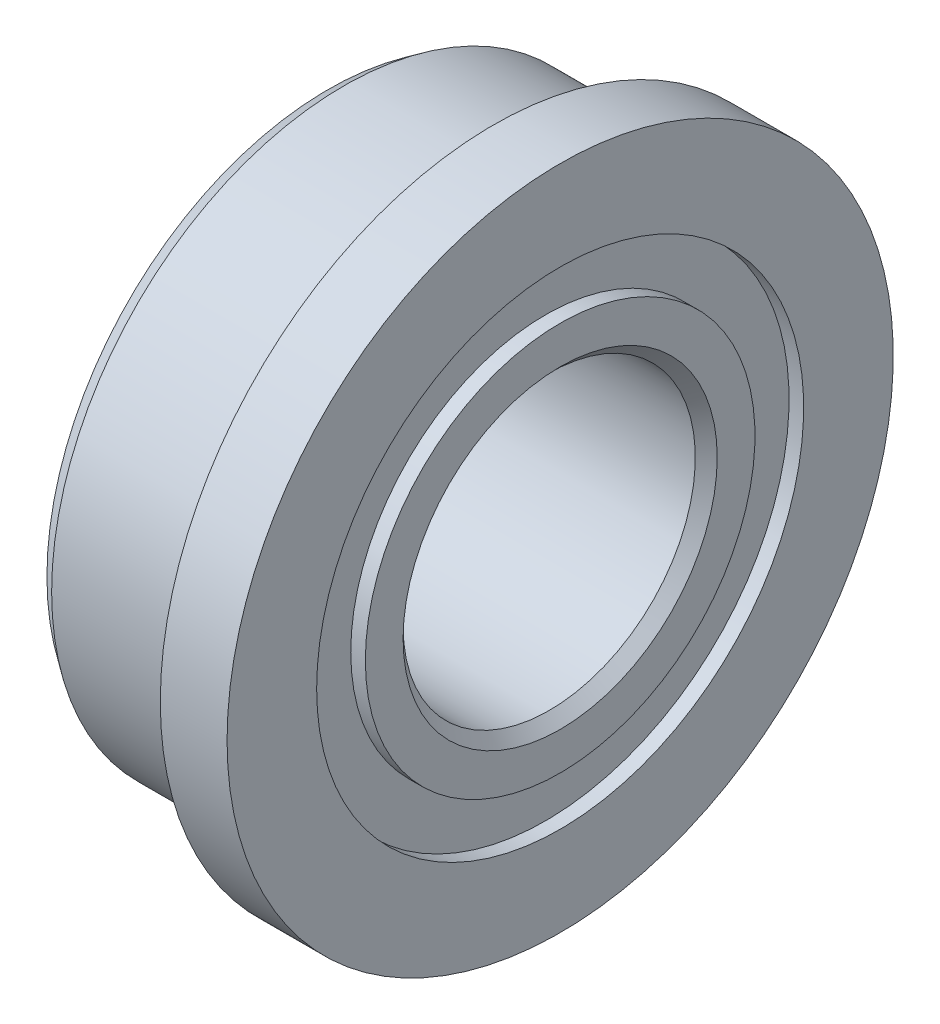
ISO-10303-21;
HEADER;
FILE_DESCRIPTION(('STEP AP214'),'2;1');
FILE_NAME('part.step','',(''),(''),'','','');
FILE_SCHEMA(('AUTOMOTIVE_DESIGN { 1 0 10303 214 1 1 1 1 }'));
ENDSEC;
DATA;
#1=APPLICATION_CONTEXT('core data for automotive mechanical design processes');
#2=APPLICATION_PROTOCOL_DEFINITION('international standard','automotive_design',2000,#1);
#3=PRODUCT_CONTEXT('',#1,'mechanical');
#4=PRODUCT('Part','Part','',(#3));
#5=PRODUCT_RELATED_PRODUCT_CATEGORY('part','',(#4));
#6=PRODUCT_DEFINITION_FORMATION('','',#4);
#7=PRODUCT_DEFINITION_CONTEXT('part definition',#1,'design');
#8=PRODUCT_DEFINITION('design','',#6,#7);
#9=PRODUCT_DEFINITION_SHAPE('','',#8);
#10=(LENGTH_UNIT() NAMED_UNIT(*) SI_UNIT(.MILLI.,.METRE.));
#11=(NAMED_UNIT(*) PLANE_ANGLE_UNIT() SI_UNIT($,.RADIAN.));
#12=(NAMED_UNIT(*) SI_UNIT($,.STERADIAN.) SOLID_ANGLE_UNIT());
#13=UNCERTAINTY_MEASURE_WITH_UNIT(LENGTH_MEASURE(1.E-05),#10,'distance_accuracy_value','');
#14=(GEOMETRIC_REPRESENTATION_CONTEXT(3) GLOBAL_UNCERTAINTY_ASSIGNED_CONTEXT((#13)) GLOBAL_UNIT_ASSIGNED_CONTEXT((#10,
#11,#12)) REPRESENTATION_CONTEXT('',''));
#15=CARTESIAN_POINT('',(0.,0.,0.));
#16=DIRECTION('',(0.,0.,1.));
#17=DIRECTION('',(1.,0.,0.));
#18=AXIS2_PLACEMENT_3D('',#15,#16,#17);
#19=CARTESIAN_POINT('',(-4.0000000000191,-1.89186773885686E-11,0.));
#20=DIRECTION('',(1.,0.,0.));
#21=DIRECTION('',(0.,0.,1.));
#22=AXIS2_PLACEMENT_3D('',#19,#20,#21);
#23=CYLINDRICAL_SURFACE('',#22,3.33333333333333);
#24=CARTESIAN_POINT('',(-2.91107312729798,-1.89186773885686E-11,0.));
#25=DIRECTION('',(-1.,0.,0.));
#26=DIRECTION('',(0.,0.,1.));
#27=AXIS2_PLACEMENT_3D('',#24,#25,#26);
#28=CIRCLE('',#27,3.33333333333333);
#29=CARTESIAN_POINT('',(-2.91107312729798,-1.89186773885686E-11,3.33333333333333));
#30=VERTEX_POINT('',#29);
#31=EDGE_CURVE('E93',#30,#30,#28,.T.);
#32=ORIENTED_EDGE('',*,*,#31,.F.);
#33=EDGE_LOOP('',(#32));
#34=FACE_BOUND('',#33,.T.);
#35=CARTESIAN_POINT('',(-3.17507312736301,-1.89186773885686E-11,0.));
#36=DIRECTION('',(-1.,0.,0.));
#37=DIRECTION('',(0.,0.,1.));
#38=AXIS2_PLACEMENT_3D('',#35,#36,#37);
#39=CIRCLE('',#38,3.33333333333333);
#40=CARTESIAN_POINT('',(-3.17507312736301,-1.89186773885686E-11,3.33333333333333));
#41=VERTEX_POINT('',#40);
#42=EDGE_CURVE('E10',#41,#41,#39,.T.);
#43=ORIENTED_EDGE('',*,*,#42,.T.);
#44=EDGE_LOOP('',(#43));
#45=FACE_BOUND('',#44,.T.);
#46=ADVANCED_FACE('F35',(#34,#45),#23,.F.);
#47=CARTESIAN_POINT('',(-3.17507312736301,3.85010438242014,0.));
#48=DIRECTION('',(-1.,0.,0.));
#49=DIRECTION('',(0.,0.,-1.));
#50=AXIS2_PLACEMENT_3D('',#47,#48,#49);
#51=PLANE('',#50);
#52=ORIENTED_EDGE('',*,*,#42,.F.);
#53=EDGE_LOOP('',(#52));
#54=FACE_BOUND('',#53,.T.);
#55=CARTESIAN_POINT('',(-3.17507312736301,-1.89186773885686E-11,0.));
#56=DIRECTION('',(-1.,0.,0.));
#57=DIRECTION('',(0.,0.,1.));
#58=AXIS2_PLACEMENT_3D('',#55,#56,#57);
#59=CIRCLE('',#58,3.85010438243906);
#60=CARTESIAN_POINT('',(-3.17507312736301,-1.89186773885686E-11,3.85010438243906));
#61=VERTEX_POINT('',#60);
#62=EDGE_CURVE('E41',#61,#61,#59,.T.);
#63=ORIENTED_EDGE('',*,*,#62,.T.);
#64=EDGE_LOOP('',(#63));
#65=FACE_BOUND('',#64,.T.);
#66=ADVANCED_FACE('F100',(#54,#65),#51,.T.);
#67=CARTESIAN_POINT('',(-2.96099999992397,-1.89186773885686E-11,0.));
#68=DIRECTION('',(1.,0.,0.));
#69=DIRECTION('',(0.,0.,1.));
#70=AXIS2_PLACEMENT_3D('',#67,#68,#69);
#71=CONICAL_SURFACE('',#70,4.,0.610865238198014);
#72=ORIENTED_EDGE('',*,*,#62,.F.);
#73=EDGE_LOOP('',(#72));
#74=FACE_BOUND('',#73,.T.);
#75=CARTESIAN_POINT('',(-2.96099999992397,-1.89186773885686E-11,0.));
#76=DIRECTION('',(-1.,0.,0.));
#77=DIRECTION('',(0.,0.,1.));
#78=AXIS2_PLACEMENT_3D('',#75,#76,#77);
#79=CIRCLE('',#78,4.);
#80=CARTESIAN_POINT('',(-2.96099999992397,-1.89186773885686E-11,4.));
#81=VERTEX_POINT('',#80);
#82=EDGE_CURVE('E45',#81,#81,#79,.T.);
#83=ORIENTED_EDGE('',*,*,#82,.T.);
#84=EDGE_LOOP('',(#83));
#85=FACE_BOUND('',#84,.T.);
#86=ADVANCED_FACE('F104',(#74,#85),#71,.T.);
#87=CARTESIAN_POINT('',(-4.0000000000191,-1.89186773885686E-11,0.));
#88=DIRECTION('',(1.,0.,0.));
#89=DIRECTION('',(0.,0.,1.));
#90=AXIS2_PLACEMENT_3D('',#87,#88,#89);
#91=CYLINDRICAL_SURFACE('',#90,4.);
#92=ORIENTED_EDGE('',*,*,#82,.F.);
#93=EDGE_LOOP('',(#92));
#94=FACE_BOUND('',#93,.T.);
#95=CARTESIAN_POINT('',(-0.934073127363007,-1.89186773885686E-11,0.));
#96=DIRECTION('',(-1.,0.,0.));
#97=DIRECTION('',(0.,0.,1.));
#98=AXIS2_PLACEMENT_3D('',#95,#96,#97);
#99=CIRCLE('',#98,4.);
#100=CARTESIAN_POINT('',(-0.934073127363007,-1.89186773885686E-11,4.));
#101=VERTEX_POINT('',#100);
#102=EDGE_CURVE('E49',#101,#101,#99,.T.);
#103=ORIENTED_EDGE('',*,*,#102,.T.);
#104=EDGE_LOOP('',(#103));
#105=FACE_BOUND('',#104,.T.);
#106=ADVANCED_FACE('F109',(#94,#105),#91,.T.);
#107=CARTESIAN_POINT('',(-0.914073127363007,-1.89188942290031E-11,0.));
#108=DIRECTION('',(1.,0.,0.));
#109=DIRECTION('',(0.,0.,1.));
#110=AXIS2_PLACEMENT_3D('',#107,#108,#109);
#111=TOROIDAL_SURFACE('',#110,4.,0.0200000000000001);
#112=ORIENTED_EDGE('',*,*,#102,.F.);
#113=EDGE_LOOP('',(#112));
#114=FACE_BOUND('',#113,.T.);
#115=CARTESIAN_POINT('',(-0.914073127363007,-1.89186773885686E-11,0.));
#116=DIRECTION('',(-1.,0.,0.));
#117=DIRECTION('',(0.,0.,1.));
#118=AXIS2_PLACEMENT_3D('',#115,#116,#117);
#119=CIRCLE('',#118,4.02);
#120=CARTESIAN_POINT('',(-0.914073127363007,-1.89186773885686E-11,4.02));
#121=VERTEX_POINT('',#120);
#122=EDGE_CURVE('E54',#121,#121,#119,.T.);
#123=ORIENTED_EDGE('',*,*,#122,.T.);
#124=EDGE_LOOP('',(#123));
#125=FACE_BOUND('',#124,.T.);
#126=ADVANCED_FACE('F115',(#114,#125),#111,.F.);
#127=CARTESIAN_POINT('',(-0.914073127363007,4.55949999998108,0.));
#128=DIRECTION('',(-1.,0.,0.));
#129=DIRECTION('',(0.,0.,-1.));
#130=AXIS2_PLACEMENT_3D('',#127,#128,#129);
#131=PLANE('',#130);
#132=ORIENTED_EDGE('',*,*,#122,.F.);
#133=EDGE_LOOP('',(#132));
#134=FACE_BOUND('',#133,.T.);
#135=CARTESIAN_POINT('',(-0.914073127363007,-1.89186773885686E-11,0.));
#136=DIRECTION('',(-1.,0.,0.));
#137=DIRECTION('',(0.,0.,1.));
#138=AXIS2_PLACEMENT_3D('',#135,#136,#137);
#139=CIRCLE('',#138,4.5595);
#140=CARTESIAN_POINT('',(-0.914073127363007,-1.89186773885686E-11,4.5595));
#141=VERTEX_POINT('',#140);
#142=EDGE_CURVE('E57',#141,#141,#139,.T.);
#143=ORIENTED_EDGE('',*,*,#142,.T.);
#144=EDGE_LOOP('',(#143));
#145=FACE_BOUND('',#144,.T.);
#146=ADVANCED_FACE('F119',(#134,#145),#131,.T.);
#147=CARTESIAN_POINT('',(-4.0000000000191,-1.89186773885686E-11,0.));
#148=DIRECTION('',(1.,0.,0.));
#149=DIRECTION('',(0.,0.,1.));
#150=AXIS2_PLACEMENT_3D('',#147,#148,#149);
#151=CYLINDRICAL_SURFACE('',#150,4.5595);
#152=ORIENTED_EDGE('',*,*,#142,.F.);
#153=EDGE_LOOP('',(#152));
#154=FACE_BOUND('',#153,.T.);
#155=CARTESIAN_POINT('',(-7.31273630070334E-05,-1.89186773885686E-11,0.));
#156=DIRECTION('',(-1.,0.,0.));
#157=DIRECTION('',(0.,0.,1.));
#158=AXIS2_PLACEMENT_3D('',#155,#156,#157);
#159=CIRCLE('',#158,4.5595);
#160=CARTESIAN_POINT('',(-7.31273630070334E-05,-1.89186773885686E-11,4.5595));
#161=VERTEX_POINT('',#160);
#162=EDGE_CURVE('E60',#161,#161,#159,.T.);
#163=ORIENTED_EDGE('',*,*,#162,.T.);
#164=EDGE_LOOP('',(#163));
#165=FACE_BOUND('',#164,.T.);
#166=ADVANCED_FACE('F123',(#154,#165),#151,.T.);
#167=CARTESIAN_POINT('',(-7.31273630073948E-05,3.33333333331441,0.));
#168=DIRECTION('',(1.,0.,0.));
#169=DIRECTION('',(0.,0.,1.));
#170=AXIS2_PLACEMENT_3D('',#167,#168,#169);
#171=PLANE('',#170);
#172=ORIENTED_EDGE('',*,*,#162,.F.);
#173=EDGE_LOOP('',(#172));
#174=FACE_BOUND('',#173,.T.);
#175=CARTESIAN_POINT('',(-7.31273630070334E-05,-1.89186773885686E-11,0.));
#176=DIRECTION('',(-1.,0.,0.));
#177=DIRECTION('',(0.,0.,1.));
#178=AXIS2_PLACEMENT_3D('',#175,#176,#177);
#179=CIRCLE('',#178,3.33333333333333);
#180=CARTESIAN_POINT('',(-7.31273630070334E-05,-1.89186773885686E-11,3.33333333333333));
#181=VERTEX_POINT('',#180);
#182=EDGE_CURVE('E63',#181,#181,#179,.T.);
#183=ORIENTED_EDGE('',*,*,#182,.T.);
#184=EDGE_LOOP('',(#183));
#185=FACE_BOUND('',#184,.T.);
#186=ADVANCED_FACE('F127',(#174,#185),#171,.T.);
#187=CARTESIAN_POINT('',(-4.0000000000191,-1.89186773885686E-11,0.));
#188=DIRECTION('',(1.,0.,0.));
#189=DIRECTION('',(0.,0.,1.));
#190=AXIS2_PLACEMENT_3D('',#187,#188,#189);
#191=CYLINDRICAL_SURFACE('',#190,3.33333333333333);
#192=ORIENTED_EDGE('',*,*,#182,.F.);
#193=EDGE_LOOP('',(#192));
#194=FACE_BOUND('',#193,.T.);
#195=CARTESIAN_POINT('',(-0.2,-1.89186773885686E-11,0.));
#196=DIRECTION('',(-1.,0.,0.));
#197=DIRECTION('',(0.,0.,1.));
#198=AXIS2_PLACEMENT_3D('',#195,#196,#197);
#199=CIRCLE('',#198,3.33333333333333);
#200=CARTESIAN_POINT('',(-0.2,-1.89186773885686E-11,3.33333333333333));
#201=VERTEX_POINT('',#200);
#202=EDGE_CURVE('E66',#201,#201,#199,.T.);
#203=ORIENTED_EDGE('',*,*,#202,.T.);
#204=EDGE_LOOP('',(#203));
#205=FACE_BOUND('',#204,.T.);
#206=ADVANCED_FACE('F131',(#194,#205),#191,.F.);
#207=CARTESIAN_POINT('',(-0.2,2.66666666664775,0.));
#208=DIRECTION('',(1.,0.,0.));
#209=DIRECTION('',(0.,0.,1.));
#210=AXIS2_PLACEMENT_3D('',#207,#208,#209);
#211=PLANE('',#210);
#212=ORIENTED_EDGE('',*,*,#202,.F.);
#213=EDGE_LOOP('',(#212));
#214=FACE_BOUND('',#213,.T.);
#215=CARTESIAN_POINT('',(-0.2,-1.89186773885686E-11,0.));
#216=DIRECTION('',(-1.,0.,0.));
#217=DIRECTION('',(0.,0.,1.));
#218=AXIS2_PLACEMENT_3D('',#215,#216,#217);
#219=CIRCLE('',#218,2.66666666666667);
#220=CARTESIAN_POINT('',(-0.2,-1.89186773885686E-11,2.66666666666667));
#221=VERTEX_POINT('',#220);
#222=EDGE_CURVE('E69',#221,#221,#219,.T.);
#223=ORIENTED_EDGE('',*,*,#222,.T.);
#224=EDGE_LOOP('',(#223));
#225=FACE_BOUND('',#224,.T.);
#226=ADVANCED_FACE('F135',(#214,#225),#211,.T.);
#227=CARTESIAN_POINT('',(-4.0000000000191,-1.89186773885686E-11,0.));
#228=DIRECTION('',(1.,0.,0.));
#229=DIRECTION('',(0.,0.,1.));
#230=AXIS2_PLACEMENT_3D('',#227,#228,#229);
#231=CYLINDRICAL_SURFACE('',#230,2.66666666666667);
#232=ORIENTED_EDGE('',*,*,#222,.F.);
#233=EDGE_LOOP('',(#232));
#234=FACE_BOUND('',#233,.T.);
#235=CARTESIAN_POINT('',(-7.31273630070334E-05,-1.89186773885686E-11,0.));
#236=DIRECTION('',(-1.,0.,0.));
#237=DIRECTION('',(0.,0.,1.));
#238=AXIS2_PLACEMENT_3D('',#235,#236,#237);
#239=CIRCLE('',#238,2.66666666666667);
#240=CARTESIAN_POINT('',(-7.31273630070334E-05,-1.89186773885686E-11,2.66666666666667));
#241=VERTEX_POINT('',#240);
#242=EDGE_CURVE('E72',#241,#241,#239,.T.);
#243=ORIENTED_EDGE('',*,*,#242,.T.);
#244=EDGE_LOOP('',(#243));
#245=FACE_BOUND('',#244,.T.);
#246=ADVANCED_FACE('F139',(#234,#245),#231,.T.);
#247=CARTESIAN_POINT('',(-7.31273630073834E-05,2.15010438245956,0.));
#248=DIRECTION('',(1.,0.,0.));
#249=DIRECTION('',(0.,0.,1.));
#250=AXIS2_PLACEMENT_3D('',#247,#248,#249);
#251=PLANE('',#250);
#252=ORIENTED_EDGE('',*,*,#242,.F.);
#253=EDGE_LOOP('',(#252));
#254=FACE_BOUND('',#253,.T.);
#255=CARTESIAN_POINT('',(-7.31273630070334E-05,-1.89186773885686E-11,0.));
#256=DIRECTION('',(-1.,0.,0.));
#257=DIRECTION('',(0.,0.,1.));
#258=AXIS2_PLACEMENT_3D('',#255,#256,#257);
#259=CIRCLE('',#258,2.15010438247848);
#260=CARTESIAN_POINT('',(-7.31273630070334E-05,-1.89186773885686E-11,2.15010438247848));
#261=VERTEX_POINT('',#260);
#262=EDGE_CURVE('E75',#261,#261,#259,.T.);
#263=ORIENTED_EDGE('',*,*,#262,.T.);
#264=EDGE_LOOP('',(#263));
#265=FACE_BOUND('',#264,.T.);
#266=ADVANCED_FACE('F143',(#254,#265),#251,.T.);
#267=CARTESIAN_POINT('',(-0.149968672244967,-1.89186773885686E-11,0.));
#268=DIRECTION('',(1.,0.,0.));
#269=DIRECTION('',(0.,0.,1.));
#270=AXIS2_PLACEMENT_3D('',#267,#268,#269);
#271=CONICAL_SURFACE('',#270,2.,0.786094288775304);
#272=ORIENTED_EDGE('',*,*,#262,.F.);
#273=EDGE_LOOP('',(#272));
#274=FACE_BOUND('',#273,.T.);
#275=CARTESIAN_POINT('',(-0.149968672244967,-1.89186773885686E-11,0.));
#276=DIRECTION('',(-1.,0.,0.));
#277=DIRECTION('',(0.,0.,1.));
#278=AXIS2_PLACEMENT_3D('',#275,#276,#277);
#279=CIRCLE('',#278,2.);
#280=CARTESIAN_POINT('',(-0.149968672244967,-1.89186773885686E-11,2.));
#281=VERTEX_POINT('',#280);
#282=EDGE_CURVE('E78',#281,#281,#279,.T.);
#283=ORIENTED_EDGE('',*,*,#282,.T.);
#284=EDGE_LOOP('',(#283));
#285=FACE_BOUND('',#284,.T.);
#286=ADVANCED_FACE('F147',(#274,#285),#271,.F.);
#287=CARTESIAN_POINT('',(-4.0000000000191,-1.89186773885686E-11,0.));
#288=DIRECTION('',(1.,0.,0.));
#289=DIRECTION('',(0.,0.,1.));
#290=AXIS2_PLACEMENT_3D('',#287,#288,#289);
#291=CYLINDRICAL_SURFACE('',#290,2.);
#292=ORIENTED_EDGE('',*,*,#282,.F.);
#293=EDGE_LOOP('',(#292));
#294=FACE_BOUND('',#293,.T.);
#295=CARTESIAN_POINT('',(-2.96114633056183,-1.89186773885686E-11,0.));
#296=DIRECTION('',(-1.,0.,0.));
#297=DIRECTION('',(0.,0.,1.));
#298=AXIS2_PLACEMENT_3D('',#295,#296,#297);
#299=CIRCLE('',#298,2.);
#300=CARTESIAN_POINT('',(-2.96114633056183,-1.89186773885686E-11,2.));
#301=VERTEX_POINT('',#300);
#302=EDGE_CURVE('E81',#301,#301,#299,.T.);
#303=ORIENTED_EDGE('',*,*,#302,.T.);
#304=EDGE_LOOP('',(#303));
#305=FACE_BOUND('',#304,.T.);
#306=ADVANCED_FACE('F151',(#294,#305),#291,.F.);
#307=CARTESIAN_POINT('',(-3.17507312736301,-1.89186773885686E-11,0.));
#308=DIRECTION('',(-1.,0.,0.));
#309=DIRECTION('',(0.,0.,-1.));
#310=AXIS2_PLACEMENT_3D('',#307,#308,#309);
#311=CONICAL_SURFACE('',#310,2.15010438247848,0.611840775427929);
#312=ORIENTED_EDGE('',*,*,#302,.F.);
#313=EDGE_LOOP('',(#312));
#314=FACE_BOUND('',#313,.T.);
#315=CARTESIAN_POINT('',(-3.17507312736301,-1.89186773885686E-11,0.));
#316=DIRECTION('',(-1.,0.,0.));
#317=DIRECTION('',(0.,0.,1.));
#318=AXIS2_PLACEMENT_3D('',#315,#316,#317);
#319=CIRCLE('',#318,2.15010438247848);
#320=CARTESIAN_POINT('',(-3.17507312736301,-1.89186773885686E-11,2.15010438247848));
#321=VERTEX_POINT('',#320);
#322=EDGE_CURVE('E84',#321,#321,#319,.T.);
#323=ORIENTED_EDGE('',*,*,#322,.T.);
#324=EDGE_LOOP('',(#323));
#325=FACE_BOUND('',#324,.T.);
#326=ADVANCED_FACE('F155',(#314,#325),#311,.F.);
#327=CARTESIAN_POINT('',(-3.17507312736301,2.66666666664775,0.));
#328=DIRECTION('',(-1.,0.,0.));
#329=DIRECTION('',(0.,0.,-1.));
#330=AXIS2_PLACEMENT_3D('',#327,#328,#329);
#331=PLANE('',#330);
#332=ORIENTED_EDGE('',*,*,#322,.F.);
#333=EDGE_LOOP('',(#332));
#334=FACE_BOUND('',#333,.T.);
#335=CARTESIAN_POINT('',(-3.17507312736301,-1.89186773885686E-11,0.));
#336=DIRECTION('',(-1.,0.,0.));
#337=DIRECTION('',(0.,0.,1.));
#338=AXIS2_PLACEMENT_3D('',#335,#336,#337);
#339=CIRCLE('',#338,2.66666666666667);
#340=CARTESIAN_POINT('',(-3.17507312736301,-1.89186773885686E-11,2.66666666666667));
#341=VERTEX_POINT('',#340);
#342=EDGE_CURVE('E87',#341,#341,#339,.T.);
#343=ORIENTED_EDGE('',*,*,#342,.T.);
#344=EDGE_LOOP('',(#343));
#345=FACE_BOUND('',#344,.T.);
#346=ADVANCED_FACE('F159',(#334,#345),#331,.T.);
#347=CARTESIAN_POINT('',(-4.0000000000191,-1.89186773885686E-11,0.));
#348=DIRECTION('',(1.,0.,0.));
#349=DIRECTION('',(0.,0.,1.));
#350=AXIS2_PLACEMENT_3D('',#347,#348,#349);
#351=CYLINDRICAL_SURFACE('',#350,2.66666666666667);
#352=ORIENTED_EDGE('',*,*,#342,.F.);
#353=EDGE_LOOP('',(#352));
#354=FACE_BOUND('',#353,.T.);
#355=CARTESIAN_POINT('',(-2.91107312729798,-1.89186773885686E-11,0.));
#356=DIRECTION('',(-1.,0.,0.));
#357=DIRECTION('',(0.,0.,1.));
#358=AXIS2_PLACEMENT_3D('',#355,#356,#357);
#359=CIRCLE('',#358,2.66666666666667);
#360=CARTESIAN_POINT('',(-2.91107312729798,-1.89186773885686E-11,2.66666666666667));
#361=VERTEX_POINT('',#360);
#362=EDGE_CURVE('E90',#361,#361,#359,.T.);
#363=ORIENTED_EDGE('',*,*,#362,.T.);
#364=EDGE_LOOP('',(#363));
#365=FACE_BOUND('',#364,.T.);
#366=ADVANCED_FACE('F163',(#354,#365),#351,.T.);
#367=CARTESIAN_POINT('',(-2.91107312729798,3.33333333331441,0.));
#368=DIRECTION('',(-1.,0.,0.));
#369=DIRECTION('',(0.,0.,-1.));
#370=AXIS2_PLACEMENT_3D('',#367,#368,#369);
#371=PLANE('',#370);
#372=ORIENTED_EDGE('',*,*,#362,.F.);
#373=EDGE_LOOP('',(#372));
#374=FACE_BOUND('',#373,.T.);
#375=ORIENTED_EDGE('',*,*,#31,.T.);
#376=EDGE_LOOP('',(#375));
#377=FACE_BOUND('',#376,.T.);
#378=ADVANCED_FACE('F97',(#374,#377),#371,.T.);
#379=CLOSED_SHELL('',(#46,#66,#86,#106,#126,#146,#166,#186,#206,#226,#246,#266,#286,#306,#326,
#346,#366,#378));
#380=MANIFOLD_SOLID_BREP('B2',#379);
#381=ADVANCED_BREP_SHAPE_REPRESENTATION('',(#18,#380),#14);
#382=SHAPE_DEFINITION_REPRESENTATION(#9,#381);
ENDSEC;
END-ISO-10303-21;
